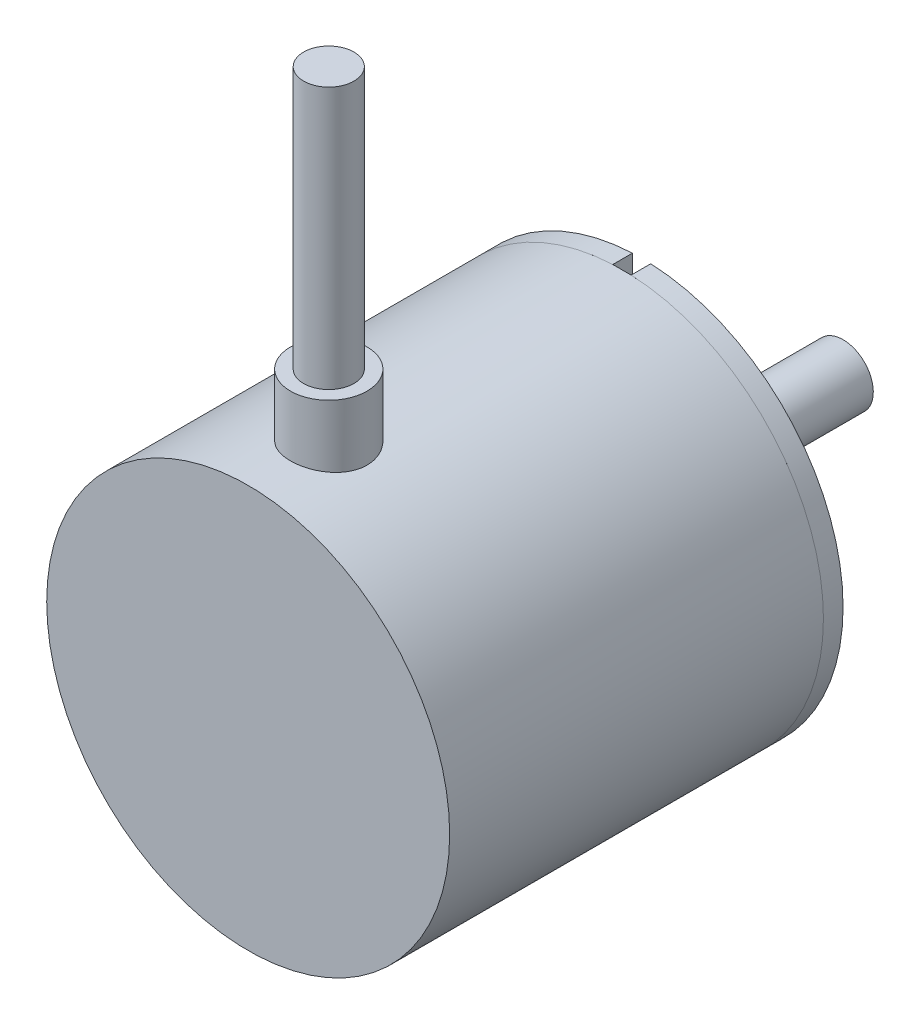
ISO-10303-21;
HEADER;
FILE_DESCRIPTION(('STEP AP214'),'2;1');
FILE_NAME('part.step','',(''),(''),'','','');
FILE_SCHEMA(('AUTOMOTIVE_DESIGN { 1 0 10303 214 1 1 1 1 }'));
ENDSEC;
DATA;
#1=APPLICATION_CONTEXT('core data for automotive mechanical design processes');
#2=APPLICATION_PROTOCOL_DEFINITION('international standard','automotive_design',2000,#1);
#3=PRODUCT_CONTEXT('',#1,'mechanical');
#4=PRODUCT('Part','Part','',(#3));
#5=PRODUCT_RELATED_PRODUCT_CATEGORY('part','',(#4));
#6=PRODUCT_DEFINITION_FORMATION('','',#4);
#7=PRODUCT_DEFINITION_CONTEXT('part definition',#1,'design');
#8=PRODUCT_DEFINITION('design','',#6,#7);
#9=PRODUCT_DEFINITION_SHAPE('','',#8);
#10=(LENGTH_UNIT() NAMED_UNIT(*) SI_UNIT(.MILLI.,.METRE.));
#11=(NAMED_UNIT(*) PLANE_ANGLE_UNIT() SI_UNIT($,.RADIAN.));
#12=(NAMED_UNIT(*) SI_UNIT($,.STERADIAN.) SOLID_ANGLE_UNIT());
#13=UNCERTAINTY_MEASURE_WITH_UNIT(LENGTH_MEASURE(1.E-05),#10,'distance_accuracy_value','');
#14=(GEOMETRIC_REPRESENTATION_CONTEXT(3) GLOBAL_UNCERTAINTY_ASSIGNED_CONTEXT((#13)) GLOBAL_UNIT_ASSIGNED_CONTEXT((#10,
#11,#12)) REPRESENTATION_CONTEXT('',''));
#15=CARTESIAN_POINT('',(0.,0.,0.));
#16=DIRECTION('',(0.,0.,1.));
#17=DIRECTION('',(1.,0.,0.));
#18=AXIS2_PLACEMENT_3D('',#15,#16,#17);
#19=CARTESIAN_POINT('',(0.,0.,0.));
#20=DIRECTION('',(0.,0.,1.));
#21=DIRECTION('',(1.,0.,0.));
#22=AXIS2_PLACEMENT_3D('',#19,#20,#21);
#23=PLANE('',#22);
#24=CARTESIAN_POINT('',(0.,0.,0.));
#25=DIRECTION('',(0.,0.,1.));
#26=DIRECTION('',(1.,0.,0.));
#27=AXIS2_PLACEMENT_3D('',#24,#25,#26);
#28=CIRCLE('',#27,10.);
#29=CARTESIAN_POINT('',(10.,0.,0.));
#30=VERTEX_POINT('',#29);
#31=EDGE_CURVE('E140',#30,#30,#28,.F.);
#32=ORIENTED_EDGE('',*,*,#31,.F.);
#33=EDGE_LOOP('',(#32));
#34=FACE_BOUND('',#33,.T.);
#35=CARTESIAN_POINT('',(0.,15.,0.));
#36=DIRECTION('',(0.,0.,-1.));
#37=DIRECTION('',(-1.,0.,0.));
#38=AXIS2_PLACEMENT_3D('',#35,#36,#37);
#39=CIRCLE('',#38,1.00000000000079);
#40=CARTESIAN_POINT('',(-1.00000000000079,15.,0.));
#41=VERTEX_POINT('',#40);
#42=EDGE_CURVE('E154',#41,#41,#39,.T.);
#43=ORIENTED_EDGE('',*,*,#42,.F.);
#44=EDGE_LOOP('',(#43));
#45=FACE_BOUND('',#44,.T.);
#46=CARTESIAN_POINT('',(-12.9903810567675,-7.49999999999947,0.));
#47=DIRECTION('',(0.,0.,-1.));
#48=DIRECTION('',(-1.,0.,0.));
#49=AXIS2_PLACEMENT_3D('',#46,#47,#48);
#50=CIRCLE('',#49,1.00000000000079);
#51=CARTESIAN_POINT('',(-13.9903810567683,-7.49999999999947,0.));
#52=VERTEX_POINT('',#51);
#53=EDGE_CURVE('E159',#52,#52,#50,.T.);
#54=ORIENTED_EDGE('',*,*,#53,.F.);
#55=EDGE_LOOP('',(#54));
#56=FACE_BOUND('',#55,.T.);
#57=CARTESIAN_POINT('',(12.9903810567657,-7.50000000000052,0.));
#58=DIRECTION('',(0.,0.,-1.));
#59=DIRECTION('',(-1.,0.,0.));
#60=AXIS2_PLACEMENT_3D('',#57,#58,#59);
#61=CIRCLE('',#60,1.00000000000079);
#62=CARTESIAN_POINT('',(11.9903810567649,-7.50000000000052,0.));
#63=VERTEX_POINT('',#62);
#64=EDGE_CURVE('E163',#63,#63,#61,.T.);
#65=ORIENTED_EDGE('',*,*,#64,.F.);
#66=EDGE_LOOP('',(#65));
#67=FACE_BOUND('',#66,.T.);
#68=DIRECTION('',(0.,-1.,0.));
#69=VECTOR('',#68,1.);
#70=CARTESIAN_POINT('',(-0.91,0.,0.));
#71=LINE('',#70,#69);
#72=CARTESIAN_POINT('',(-0.91,19.9792867740568,0.));
#73=VERTEX_POINT('',#72);
#74=CARTESIAN_POINT('',(-0.91,18.0794623505173,0.));
#75=VERTEX_POINT('',#74);
#76=EDGE_CURVE('E109',#73,#75,#71,.T.);
#77=ORIENTED_EDGE('',*,*,#76,.T.);
#78=DIRECTION('',(-1.,0.,0.));
#79=VECTOR('',#78,1.);
#80=CARTESIAN_POINT('',(0.,18.0794623505173,0.));
#81=LINE('',#80,#79);
#82=CARTESIAN_POINT('',(0.91,18.0794623505173,0.));
#83=VERTEX_POINT('',#82);
#84=EDGE_CURVE('E91',#83,#75,#81,.T.);
#85=ORIENTED_EDGE('',*,*,#84,.F.);
#86=DIRECTION('',(0.,-1.,0.));
#87=VECTOR('',#86,1.);
#88=CARTESIAN_POINT('',(0.91,0.,0.));
#89=LINE('',#88,#87);
#90=CARTESIAN_POINT('',(0.91,19.9792867740568,0.));
#91=VERTEX_POINT('',#90);
#92=EDGE_CURVE('E99',#91,#83,#89,.T.);
#93=ORIENTED_EDGE('',*,*,#92,.F.);
#94=CARTESIAN_POINT('',(0.,0.,0.));
#95=DIRECTION('',(0.,0.,1.));
#96=DIRECTION('',(1.,0.,0.));
#97=AXIS2_PLACEMENT_3D('',#94,#95,#96);
#98=CIRCLE('',#97,20.);
#99=EDGE_CURVE('E170',#73,#91,#98,.T.);
#100=ORIENTED_EDGE('',*,*,#99,.F.);
#101=EDGE_LOOP('',(#77,#85,#93,#100));
#102=FACE_BOUND('',#101,.T.);
#103=ADVANCED_FACE('F52',(#34,#45,#56,#67,#102),#23,.F.);
#104=CARTESIAN_POINT('',(0.,0.,1.95));
#105=DIRECTION('',(0.,0.,-1.));
#106=DIRECTION('',(-1.,0.,0.));
#107=AXIS2_PLACEMENT_3D('',#104,#105,#106);
#108=CYLINDRICAL_SURFACE('',#107,20.);
#109=DIRECTION('',(0.,0.,-1.));
#110=VECTOR('',#109,1.);
#111=CARTESIAN_POINT('',(-0.91,19.9792867740568,2.3));
#112=LINE('',#111,#110);
#113=CARTESIAN_POINT('',(-0.91,19.9792867740568,1.95));
#114=VERTEX_POINT('',#113);
#115=EDGE_CURVE('E121',#114,#73,#112,.T.);
#116=ORIENTED_EDGE('',*,*,#115,.T.);
#117=ORIENTED_EDGE('',*,*,#99,.T.);
#118=DIRECTION('',(0.,0.,-1.));
#119=VECTOR('',#118,1.);
#120=CARTESIAN_POINT('',(0.91,19.9792867740568,2.3));
#121=LINE('',#120,#119);
#122=CARTESIAN_POINT('',(0.91,19.9792867740568,1.95));
#123=VERTEX_POINT('',#122);
#124=EDGE_CURVE('E102',#123,#91,#121,.T.);
#125=ORIENTED_EDGE('',*,*,#124,.F.);
#126=CARTESIAN_POINT('',(0.,0.,1.95));
#127=DIRECTION('',(0.,0.,1.));
#128=DIRECTION('',(1.,0.,0.));
#129=AXIS2_PLACEMENT_3D('',#126,#127,#128);
#130=CIRCLE('',#129,20.);
#131=EDGE_CURVE('E141',#114,#123,#130,.T.);
#132=ORIENTED_EDGE('',*,*,#131,.F.);
#133=EDGE_LOOP('',(#116,#117,#125,#132));
#134=FACE_BOUND('',#133,.T.);
#135=ADVANCED_FACE('F192',(#134),#108,.T.);
#136=CARTESIAN_POINT('',(0.,0.,1.95));
#137=DIRECTION('',(0.,0.,1.));
#138=DIRECTION('',(1.,0.,0.));
#139=AXIS2_PLACEMENT_3D('',#136,#137,#138);
#140=PLANE('',#139);
#141=CARTESIAN_POINT('',(0.,15.,1.95));
#142=DIRECTION('',(0.,0.,1.));
#143=DIRECTION('',(1.,0.,0.));
#144=AXIS2_PLACEMENT_3D('',#141,#142,#143);
#145=CIRCLE('',#144,1.00000000000079);
#146=CARTESIAN_POINT('',(1.00000000000079,15.,1.95));
#147=VERTEX_POINT('',#146);
#148=EDGE_CURVE('E146',#147,#147,#145,.T.);
#149=ORIENTED_EDGE('',*,*,#148,.F.);
#150=EDGE_LOOP('',(#149));
#151=FACE_BOUND('',#150,.T.);
#152=CARTESIAN_POINT('',(-12.9903810567675,-7.49999999999947,1.95));
#153=DIRECTION('',(0.,0.,1.));
#154=DIRECTION('',(1.,0.,0.));
#155=AXIS2_PLACEMENT_3D('',#152,#153,#154);
#156=CIRCLE('',#155,1.00000000000079);
#157=CARTESIAN_POINT('',(-11.9903810567667,-7.49999999999947,1.95));
#158=VERTEX_POINT('',#157);
#159=EDGE_CURVE('E158',#158,#158,#156,.T.);
#160=ORIENTED_EDGE('',*,*,#159,.F.);
#161=EDGE_LOOP('',(#160));
#162=FACE_BOUND('',#161,.T.);
#163=CARTESIAN_POINT('',(12.9903810567657,-7.50000000000052,1.95));
#164=DIRECTION('',(0.,0.,1.));
#165=DIRECTION('',(1.,0.,0.));
#166=AXIS2_PLACEMENT_3D('',#163,#164,#165);
#167=CIRCLE('',#166,1.00000000000079);
#168=CARTESIAN_POINT('',(13.9903810567665,-7.50000000000052,1.95));
#169=VERTEX_POINT('',#168);
#170=EDGE_CURVE('E162',#169,#169,#167,.T.);
#171=ORIENTED_EDGE('',*,*,#170,.F.);
#172=EDGE_LOOP('',(#171));
#173=FACE_BOUND('',#172,.T.);
#174=DIRECTION('',(1.,0.,0.));
#175=VECTOR('',#174,1.);
#176=CARTESIAN_POINT('',(0.,18.0794623505173,1.95));
#177=LINE('',#176,#175);
#178=CARTESIAN_POINT('',(-0.91,18.0794623505173,1.95));
#179=VERTEX_POINT('',#178);
#180=CARTESIAN_POINT('',(0.91,18.0794623505173,1.95));
#181=VERTEX_POINT('',#180);
#182=EDGE_CURVE('E94',#179,#181,#177,.T.);
#183=ORIENTED_EDGE('',*,*,#182,.F.);
#184=DIRECTION('',(0.,1.,0.));
#185=VECTOR('',#184,1.);
#186=CARTESIAN_POINT('',(-0.91,0.,1.95));
#187=LINE('',#186,#185);
#188=EDGE_CURVE('E150',#179,#114,#187,.T.);
#189=ORIENTED_EDGE('',*,*,#188,.T.);
#190=ORIENTED_EDGE('',*,*,#131,.T.);
#191=DIRECTION('',(0.,1.,0.));
#192=VECTOR('',#191,1.);
#193=CARTESIAN_POINT('',(0.91,0.,1.95));
#194=LINE('',#193,#192);
#195=EDGE_CURVE('E111',#181,#123,#194,.T.);
#196=ORIENTED_EDGE('',*,*,#195,.F.);
#197=EDGE_LOOP('',(#183,#189,#190,#196));
#198=FACE_BOUND('',#197,.T.);
#199=ADVANCED_FACE('F133',(#151,#162,#173,#198),#140,.T.);
#200=CARTESIAN_POINT('',(0.,0.,-5.));
#201=DIRECTION('',(0.,0.,-1.));
#202=DIRECTION('',(-1.,0.,0.));
#203=AXIS2_PLACEMENT_3D('',#200,#201,#202);
#204=PLANE('',#203);
#205=CARTESIAN_POINT('',(0.,0.,-5.));
#206=DIRECTION('',(0.,0.,-1.));
#207=DIRECTION('',(-1.,0.,0.));
#208=AXIS2_PLACEMENT_3D('',#205,#206,#207);
#209=CIRCLE('',#208,7.5);
#210=CARTESIAN_POINT('',(-7.5,0.,-5.));
#211=VERTEX_POINT('',#210);
#212=EDGE_CURVE('E62',#211,#211,#209,.T.);
#213=ORIENTED_EDGE('',*,*,#212,.F.);
#214=EDGE_LOOP('',(#213));
#215=FACE_BOUND('',#214,.T.);
#216=CARTESIAN_POINT('',(0.,0.,-5.));
#217=DIRECTION('',(0.,0.,-1.));
#218=DIRECTION('',(-1.,0.,0.));
#219=AXIS2_PLACEMENT_3D('',#216,#217,#218);
#220=CIRCLE('',#219,10.);
#221=CARTESIAN_POINT('',(-10.,0.,-5.));
#222=VERTEX_POINT('',#221);
#223=EDGE_CURVE('E137',#222,#222,#220,.T.);
#224=ORIENTED_EDGE('',*,*,#223,.T.);
#225=EDGE_LOOP('',(#224));
#226=FACE_BOUND('',#225,.T.);
#227=ADVANCED_FACE('F129',(#215,#226),#204,.T.);
#228=CARTESIAN_POINT('',(0.,0.,-5.));
#229=DIRECTION('',(0.,0.,1.));
#230=DIRECTION('',(1.,0.,0.));
#231=AXIS2_PLACEMENT_3D('',#228,#229,#230);
#232=CYLINDRICAL_SURFACE('',#231,10.);
#233=ORIENTED_EDGE('',*,*,#223,.F.);
#234=EDGE_LOOP('',(#233));
#235=FACE_BOUND('',#234,.T.);
#236=ORIENTED_EDGE('',*,*,#31,.T.);
#237=EDGE_LOOP('',(#236));
#238=FACE_BOUND('',#237,.T.);
#239=ADVANCED_FACE('F132',(#235,#238),#232,.T.);
#240=CARTESIAN_POINT('',(0.,15.,10.));
#241=DIRECTION('',(0.,0.,-1.));
#242=DIRECTION('',(-1.,0.,0.));
#243=AXIS2_PLACEMENT_3D('',#240,#241,#242);
#244=CYLINDRICAL_SURFACE('',#243,1.00000000000079);
#245=ORIENTED_EDGE('',*,*,#148,.T.);
#246=EDGE_LOOP('',(#245));
#247=FACE_BOUND('',#246,.T.);
#248=ORIENTED_EDGE('',*,*,#42,.T.);
#249=EDGE_LOOP('',(#248));
#250=FACE_BOUND('',#249,.T.);
#251=ADVANCED_FACE('F205',(#247,#250),#244,.F.);
#252=CARTESIAN_POINT('',(-12.9903810567675,-7.49999999999947,10.));
#253=DIRECTION('',(0.,0.,-1.));
#254=DIRECTION('',(-1.,0.,0.));
#255=AXIS2_PLACEMENT_3D('',#252,#253,#254);
#256=CYLINDRICAL_SURFACE('',#255,1.00000000000079);
#257=ORIENTED_EDGE('',*,*,#159,.T.);
#258=EDGE_LOOP('',(#257));
#259=FACE_BOUND('',#258,.T.);
#260=ORIENTED_EDGE('',*,*,#53,.T.);
#261=EDGE_LOOP('',(#260));
#262=FACE_BOUND('',#261,.T.);
#263=ADVANCED_FACE('F209',(#259,#262),#256,.F.);
#264=CARTESIAN_POINT('',(12.9903810567657,-7.50000000000052,10.));
#265=DIRECTION('',(0.,0.,-1.));
#266=DIRECTION('',(-1.,0.,0.));
#267=AXIS2_PLACEMENT_3D('',#264,#265,#266);
#268=CYLINDRICAL_SURFACE('',#267,1.00000000000079);
#269=ORIENTED_EDGE('',*,*,#170,.T.);
#270=EDGE_LOOP('',(#269));
#271=FACE_BOUND('',#270,.T.);
#272=ORIENTED_EDGE('',*,*,#64,.T.);
#273=EDGE_LOOP('',(#272));
#274=FACE_BOUND('',#273,.T.);
#275=ADVANCED_FACE('F213',(#271,#274),#268,.F.);
#276=CARTESIAN_POINT('',(-0.91,0.,2.3));
#277=DIRECTION('',(1.,0.,0.));
#278=DIRECTION('',(0.,0.,-1.));
#279=AXIS2_PLACEMENT_3D('',#276,#277,#278);
#280=PLANE('',#279);
#281=DIRECTION('',(0.,0.,-1.));
#282=VECTOR('',#281,1.);
#283=CARTESIAN_POINT('',(-0.91,18.0794623505173,2.3));
#284=LINE('',#283,#282);
#285=EDGE_CURVE('E118',#179,#75,#284,.T.);
#286=ORIENTED_EDGE('',*,*,#285,.T.);
#287=ORIENTED_EDGE('',*,*,#76,.F.);
#288=ORIENTED_EDGE('',*,*,#115,.F.);
#289=ORIENTED_EDGE('',*,*,#188,.F.);
#290=EDGE_LOOP('',(#286,#287,#288,#289));
#291=FACE_BOUND('',#290,.T.);
#292=ADVANCED_FACE('F191',(#291),#280,.T.);
#293=CARTESIAN_POINT('',(0.,18.0794623505173,2.3));
#294=DIRECTION('',(0.,-1.,0.));
#295=DIRECTION('',(0.,0.,-1.));
#296=AXIS2_PLACEMENT_3D('',#293,#294,#295);
#297=PLANE('',#296);
#298=ORIENTED_EDGE('',*,*,#182,.T.);
#299=DIRECTION('',(0.,0.,-1.));
#300=VECTOR('',#299,1.);
#301=CARTESIAN_POINT('',(0.91,18.0794623505173,2.3));
#302=LINE('',#301,#300);
#303=EDGE_CURVE('E70',#181,#83,#302,.T.);
#304=ORIENTED_EDGE('',*,*,#303,.T.);
#305=ORIENTED_EDGE('',*,*,#84,.T.);
#306=ORIENTED_EDGE('',*,*,#285,.F.);
#307=EDGE_LOOP('',(#298,#304,#305,#306));
#308=FACE_BOUND('',#307,.T.);
#309=ADVANCED_FACE('F88',(#308),#297,.F.);
#310=CARTESIAN_POINT('',(0.91,0.,2.3));
#311=DIRECTION('',(1.,0.,0.));
#312=DIRECTION('',(0.,0.,-1.));
#313=AXIS2_PLACEMENT_3D('',#310,#311,#312);
#314=PLANE('',#313);
#315=ORIENTED_EDGE('',*,*,#195,.T.);
#316=ORIENTED_EDGE('',*,*,#124,.T.);
#317=ORIENTED_EDGE('',*,*,#92,.T.);
#318=ORIENTED_EDGE('',*,*,#303,.F.);
#319=EDGE_LOOP('',(#315,#316,#317,#318));
#320=FACE_BOUND('',#319,.T.);
#321=ADVANCED_FACE('F100',(#320),#314,.F.);
#322=CARTESIAN_POINT('',(0.,0.,-4.9));
#323=DIRECTION('',(0.,0.,-1.));
#324=DIRECTION('',(-1.,0.,0.));
#325=AXIS2_PLACEMENT_3D('',#322,#323,#324);
#326=CYLINDRICAL_SURFACE('',#325,7.5);
#327=CARTESIAN_POINT('',(0.,0.,-4.9));
#328=DIRECTION('',(0.,0.,-1.));
#329=DIRECTION('',(-1.,0.,0.));
#330=AXIS2_PLACEMENT_3D('',#327,#328,#329);
#331=CIRCLE('',#330,7.5);
#332=CARTESIAN_POINT('',(-7.5,0.,-4.9));
#333=VERTEX_POINT('',#332);
#334=EDGE_CURVE('E12',#333,#333,#331,.T.);
#335=ORIENTED_EDGE('',*,*,#334,.F.);
#336=EDGE_LOOP('',(#335));
#337=FACE_BOUND('',#336,.T.);
#338=ORIENTED_EDGE('',*,*,#212,.T.);
#339=EDGE_LOOP('',(#338));
#340=FACE_BOUND('',#339,.T.);
#341=ADVANCED_FACE('F127',(#337,#340),#326,.F.);
#342=CARTESIAN_POINT('',(0.,0.,-4.9));
#343=DIRECTION('',(0.,0.,-1.));
#344=DIRECTION('',(-1.,0.,0.));
#345=AXIS2_PLACEMENT_3D('',#342,#343,#344);
#346=PLANE('',#345);
#347=ORIENTED_EDGE('',*,*,#334,.T.);
#348=EDGE_LOOP('',(#347));
#349=FACE_BOUND('',#348,.T.);
#350=ADVANCED_FACE('F54',(#349),#346,.T.);
#351=CLOSED_SHELL('',(#103,#135,#199,#227,#239,#251,#263,#275,#292,#309,#321,#341,#350));
#352=MANIFOLD_SOLID_BREP('B2',#351);
#353=CARTESIAN_POINT('',(0.,26.,31.05));
#354=DIRECTION('',(0.,1.,0.));
#355=DIRECTION('',(0.,0.,1.));
#356=AXIS2_PLACEMENT_3D('',#353,#354,#355);
#357=PLANE('',#356);
#358=CARTESIAN_POINT('',(0.,26.,31.05));
#359=DIRECTION('',(0.,1.,0.));
#360=DIRECTION('',(0.,0.,1.));
#361=AXIS2_PLACEMENT_3D('',#358,#359,#360);
#362=CIRCLE('',#361,3.8);
#363=CARTESIAN_POINT('',(0.,26.,34.85));
#364=VERTEX_POINT('',#363);
#365=EDGE_CURVE('E388',#364,#364,#362,.T.);
#366=ORIENTED_EDGE('',*,*,#365,.T.);
#367=EDGE_LOOP('',(#366));
#368=FACE_BOUND('',#367,.T.);
#369=CARTESIAN_POINT('',(0.,26.,31.05));
#370=DIRECTION('',(0.,1.,0.));
#371=DIRECTION('',(0.,0.,1.));
#372=AXIS2_PLACEMENT_3D('',#369,#370,#371);
#373=CIRCLE('',#372,2.5);
#374=CARTESIAN_POINT('',(0.,26.,33.55));
#375=VERTEX_POINT('',#374);
#376=EDGE_CURVE('E394',#375,#375,#373,.T.);
#377=ORIENTED_EDGE('',*,*,#376,.F.);
#378=EDGE_LOOP('',(#377));
#379=FACE_BOUND('',#378,.T.);
#380=ADVANCED_FACE('F363',(#368,#379),#357,.T.);
#381=CARTESIAN_POINT('',(0.,0.,39.05));
#382=DIRECTION('',(0.,0.,-1.));
#383=DIRECTION('',(-1.,0.,0.));
#384=AXIS2_PLACEMENT_3D('',#381,#382,#383);
#385=CYLINDRICAL_SURFACE('',#384,20.);
#386=CARTESIAN_POINT('',(0.,0.,1.95));
#387=DIRECTION('',(0.,0.,1.));
#388=DIRECTION('',(1.,0.,0.));
#389=AXIS2_PLACEMENT_3D('',#386,#387,#388);
#390=CIRCLE('',#389,20.);
#391=CARTESIAN_POINT('',(20.,0.,1.95));
#392=VERTEX_POINT('',#391);
#393=EDGE_CURVE('E382',#392,#392,#390,.T.);
#394=ORIENTED_EDGE('',*,*,#393,.T.);
#395=EDGE_LOOP('',(#394));
#396=FACE_BOUND('',#395,.T.);
#397=CARTESIAN_POINT('',(0.,0.,39.05));
#398=DIRECTION('',(0.,0.,1.));
#399=DIRECTION('',(1.,0.,0.));
#400=AXIS2_PLACEMENT_3D('',#397,#398,#399);
#401=CIRCLE('',#400,20.);
#402=CARTESIAN_POINT('',(20.,0.,39.05));
#403=VERTEX_POINT('',#402);
#404=EDGE_CURVE('E376',#403,#403,#401,.T.);
#405=ORIENTED_EDGE('',*,*,#404,.F.);
#406=EDGE_LOOP('',(#405));
#407=FACE_BOUND('',#406,.T.);
#408=CARTESIAN_POINT('',(0.,20.,27.25));
#409=CARTESIAN_POINT('',(-0.211409170467327,19.9999961542323,27.2500080221101));
#410=CARTESIAN_POINT('',(-0.422922127898354,19.9966133928819,27.2677019195789));
#411=CARTESIAN_POINT('',(-0.839984159024682,19.9834449848688,27.3379623654532));
#412=CARTESIAN_POINT('',(-1.04552810753821,19.9736539963158,27.390558008419));
#413=CARTESIAN_POINT('',(-1.44456049920717,19.9487640007985,27.528950449601));
#414=CARTESIAN_POINT('',(-1.63805977200262,19.9336698456168,27.6147169075731));
#415=CARTESIAN_POINT('',(-2.00790510956374,19.8998203363427,27.8169294664745));
#416=CARTESIAN_POINT('',(-2.18425248934359,19.8810652632604,27.9333732128719));
#417=CARTESIAN_POINT('',(-2.51697105215255,19.8417053033425,28.195152721675));
#418=CARTESIAN_POINT('',(-2.67310113064527,19.8210823362121,28.3407922378417));
#419=CARTESIAN_POINT('',(-2.95886696734129,19.7804445961867,28.6561757865699));
#420=CARTESIAN_POINT('',(-3.08850079078569,19.7604298677961,28.8259215778409));
#421=CARTESIAN_POINT('',(-3.31860168020194,19.7230988451207,29.1864090605948));
#422=CARTESIAN_POINT('',(-3.41882262654874,19.705805853158,29.37731047713));
#423=CARTESIAN_POINT('',(-3.58567706988605,19.6761314285786,29.7736245855497));
#424=CARTESIAN_POINT('',(-3.6523135449711,19.6637495604899,29.9790359889224));
#425=CARTESIAN_POINT('',(-3.74933194374608,19.6454814650498,30.3959565887778));
#426=CARTESIAN_POINT('',(-3.78013484392349,19.6395198747464,30.607364455082));
#427=CARTESIAN_POINT('',(-3.80591857594181,19.634540186021,31.0324252533447));
#428=CARTESIAN_POINT('',(-3.80090270756635,19.6355214479927,31.2460779766861));
#429=CARTESIAN_POINT('',(-3.75553244831974,19.6442480072405,31.6665079036574));
#430=CARTESIAN_POINT('',(-3.71565751410713,19.6519015293418,31.8733390341715));
#431=CARTESIAN_POINT('',(-3.60245643623646,19.6729660265244,32.277321398546));
#432=CARTESIAN_POINT('',(-3.52912883658626,19.6863772522022,32.4744722106669));
#433=CARTESIAN_POINT('',(-3.35063720584687,19.7175415756265,32.8548962890743));
#434=CARTESIAN_POINT('',(-3.24528027247544,19.7353208526614,33.038076814078));
#435=CARTESIAN_POINT('',(-3.00585703473046,19.7732007899193,33.3843394509841));
#436=CARTESIAN_POINT('',(-2.87178774114429,19.7933016917437,33.5474194674571));
#437=CARTESIAN_POINT('',(-2.57616400040746,19.8339594539179,33.8516213185564));
#438=CARTESIAN_POINT('',(-2.41419962980204,19.8545184267878,33.9923448095286));
#439=CARTESIAN_POINT('',(-2.06875314340881,19.8934769245016,34.244684963348));
#440=CARTESIAN_POINT('',(-1.88527080077558,19.9118764265761,34.3563013193038));
#441=CARTESIAN_POINT('',(-1.50157598041669,19.9444815207307,34.5473204324655));
#442=CARTESIAN_POINT('',(-1.30134198123535,19.9586816081353,34.6266809586306));
#443=CARTESIAN_POINT('',(-0.890054959011917,19.9812455258448,34.7505286338464));
#444=CARTESIAN_POINT('',(-0.679003119317512,19.9896099930434,34.7950195885914));
#445=CARTESIAN_POINT('',(-0.255497719579876,19.9994725007416,34.8473088773612));
#446=CARTESIAN_POINT('',(-0.0431138328322673,20.0010726444528,34.855652875173));
#447=CARTESIAN_POINT('',(0.380014191672976,19.9975085572427,34.836876225767));
#448=CARTESIAN_POINT('',(0.590758411707601,19.9923446679653,34.8097573697398));
#449=CARTESIAN_POINT('',(1.00288830549625,19.975896378801,34.7212784196605));
#450=CARTESIAN_POINT('',(1.20433556626006,19.9646614874827,34.6601951873359));
#451=CARTESIAN_POINT('',(1.59412952640163,19.9373258457065,34.5058215920311));
#452=CARTESIAN_POINT('',(1.78247531674335,19.9212247580245,34.4125289969003));
#453=CARTESIAN_POINT('',(2.14304328890291,19.8856880666302,34.195182519842));
#454=CARTESIAN_POINT('',(2.31506151518706,19.8662171733405,34.0707961735566));
#455=CARTESIAN_POINT('',(2.63597913374777,19.8261901171718,33.7952420238678));
#456=CARTESIAN_POINT('',(2.78487630264077,19.8056338501746,33.6440716478284));
#457=CARTESIAN_POINT('',(3.05740496097472,19.765413070904,33.3167675589537));
#458=CARTESIAN_POINT('',(3.18066362671236,19.7457645712979,33.1403211179015));
#459=CARTESIAN_POINT('',(3.39579291791139,19.7099095371909,32.7689070607635));
#460=CARTESIAN_POINT('',(3.48766472876849,19.6937028727101,32.5739401445009));
#461=CARTESIAN_POINT('',(3.63688763834375,19.6666928737216,32.1719537976212));
#462=CARTESIAN_POINT('',(3.69440774330493,19.65586313059,31.9649989621616));
#463=CARTESIAN_POINT('',(3.77381405210164,19.6407736637121,31.5441366655658));
#464=CARTESIAN_POINT('',(3.79570439701343,19.6365131764557,31.3302300153537));
#465=CARTESIAN_POINT('',(3.80308834618145,19.6350840546938,30.9052722601002));
#466=CARTESIAN_POINT('',(3.78917023724654,19.6378007920638,30.694231539121));
#467=CARTESIAN_POINT('',(3.72662235451709,19.6497654576093,30.2775567264854));
#468=CARTESIAN_POINT('',(3.67799280145929,19.6590133442521,30.071922600456));
#469=CARTESIAN_POINT('',(3.5476534675359,19.682949445638,29.6722259316191));
#470=CARTESIAN_POINT('',(3.46600904087706,19.6976269074675,29.4781413916689));
#471=CARTESIAN_POINT('',(3.27202248901276,19.7307756869829,29.1063314638588));
#472=CARTESIAN_POINT('',(3.159678114922,19.7492472825785,28.9286072757309));
#473=CARTESIAN_POINT('',(2.90544249950504,19.7882578785796,28.5916195556383));
#474=CARTESIAN_POINT('',(2.76312375644477,19.8088242859378,28.4326816630379));
#475=CARTESIAN_POINT('',(2.45386904920005,19.849503793334,28.1407474229982));
#476=CARTESIAN_POINT('',(2.28692743807455,19.8696167881647,28.0077570425845));
#477=CARTESIAN_POINT('',(1.93130804184856,19.907342517305,27.7703371149878));
#478=CARTESIAN_POINT('',(1.74244286895555,19.9249303089506,27.6661841532342));
#479=CARTESIAN_POINT('',(1.34961886753758,19.955380052388,27.4912547671515));
#480=CARTESIAN_POINT('',(1.1456743110793,19.9682464057595,27.4204472388684));
#481=CARTESIAN_POINT('',(0.784297688068416,19.9852044773219,27.328466621649));
#482=CARTESIAN_POINT('',(0.628967830047845,19.9907212439867,27.2990923477028));
#483=CARTESIAN_POINT('',(0.315777906585669,19.9981203933227,27.2598563003173));
#484=CARTESIAN_POINT('',(0.157917908583858,20.0000028727022,27.2499940076637));
#485=CARTESIAN_POINT('',(0.,20.,27.25));
#486=B_SPLINE_CURVE_WITH_KNOTS('',3,(#408,#409,#410,#411,#412,#413,#414,#415,#416,#417,#418,
#419,#420,#421,#422,#423,#424,#425,#426,#427,#428,#429,#430,#431,#432,#433,#434,#435,#436,#437,
#438,#439,#440,#441,#442,#443,#444,#445,#446,#447,#448,#449,#450,#451,#452,#453,#454,#455,#456,
#457,#458,#459,#460,#461,#462,#463,#464,#465,#466,#467,#468,#469,#470,#471,#472,#473,#474,#475,
#476,#477,#478,#479,#480,#481,#482,#483,#484,#485),.UNSPECIFIED.,.T.,.F.,(4,2,2,2,2,2,2,2,2,2,2,
2,2,2,2,2,2,2,2,2,2,2,2,2,2,2,2,2,2,2,2,2,2,2,2,2,2,2,4),(0.,0.633649957641686,1.26782879901445,
1.901428944657,2.53498047461306,3.17550182400964,3.81606992763611,4.4618545644225,
5.10758192633874,5.74564406057233,6.38364741445397,7.01301124078936,7.64240246213848,
8.27566203182482,8.90898756155413,9.55256883556786,10.1961568949143,10.8405848804157,
11.4849425227049,12.1195384701565,12.7541023660826,13.3835678603608,14.0130769861719,
14.6496287228807,15.2862416342732,15.931548745728,16.5768314830023,17.2189127787949,
17.8609194432256,18.4924463579162,19.1239692566416,19.7542481040081,20.3845731340266,
21.0245839956356,21.6647418644649,22.3108422133651,22.9563386931751,23.4296735948471,
23.9029959008938),.UNSPECIFIED.);
#487=CARTESIAN_POINT('',(0.,20.,27.25));
#488=VERTEX_POINT('',#487);
#489=EDGE_CURVE('E51',#488,#488,#486,.T.);
#490=ORIENTED_EDGE('',*,*,#489,.F.);
#491=EDGE_LOOP('',(#490));
#492=FACE_BOUND('',#491,.T.);
#493=ADVANCED_FACE('F365',(#396,#407,#492),#385,.T.);
#494=CARTESIAN_POINT('',(0.,0.,39.05));
#495=DIRECTION('',(0.,0.,1.));
#496=DIRECTION('',(1.,0.,0.));
#497=AXIS2_PLACEMENT_3D('',#494,#495,#496);
#498=PLANE('',#497);
#499=ORIENTED_EDGE('',*,*,#404,.T.);
#500=EDGE_LOOP('',(#499));
#501=FACE_BOUND('',#500,.T.);
#502=ADVANCED_FACE('F416',(#501),#498,.T.);
#503=CARTESIAN_POINT('',(0.,0.,1.95));
#504=DIRECTION('',(0.,0.,1.));
#505=DIRECTION('',(1.,0.,0.));
#506=AXIS2_PLACEMENT_3D('',#503,#504,#505);
#507=PLANE('',#506);
#508=ORIENTED_EDGE('',*,*,#393,.F.);
#509=EDGE_LOOP('',(#508));
#510=FACE_BOUND('',#509,.T.);
#511=ADVANCED_FACE('F422',(#510),#507,.F.);
#512=CARTESIAN_POINT('',(0.,26.,31.05));
#513=DIRECTION('',(0.,-1.,0.));
#514=DIRECTION('',(0.,0.,-1.));
#515=AXIS2_PLACEMENT_3D('',#512,#513,#514);
#516=CYLINDRICAL_SURFACE('',#515,3.8);
#517=ORIENTED_EDGE('',*,*,#365,.F.);
#518=EDGE_LOOP('',(#517));
#519=FACE_BOUND('',#518,.T.);
#520=ORIENTED_EDGE('',*,*,#489,.T.);
#521=EDGE_LOOP('',(#520));
#522=FACE_BOUND('',#521,.T.);
#523=ADVANCED_FACE('F406',(#519,#522),#516,.T.);
#524=CARTESIAN_POINT('',(0.,52.,31.05));
#525=DIRECTION('',(0.,-1.,0.));
#526=DIRECTION('',(0.,0.,-1.));
#527=AXIS2_PLACEMENT_3D('',#524,#525,#526);
#528=CYLINDRICAL_SURFACE('',#527,2.5);
#529=CARTESIAN_POINT('',(0.,52.,31.05));
#530=DIRECTION('',(0.,1.,0.));
#531=DIRECTION('',(0.,0.,1.));
#532=AXIS2_PLACEMENT_3D('',#529,#530,#531);
#533=CIRCLE('',#532,2.5);
#534=CARTESIAN_POINT('',(0.,52.,33.55));
#535=VERTEX_POINT('',#534);
#536=EDGE_CURVE('E393',#535,#535,#533,.T.);
#537=ORIENTED_EDGE('',*,*,#536,.F.);
#538=EDGE_LOOP('',(#537));
#539=FACE_BOUND('',#538,.T.);
#540=ORIENTED_EDGE('',*,*,#376,.T.);
#541=EDGE_LOOP('',(#540));
#542=FACE_BOUND('',#541,.T.);
#543=ADVANCED_FACE('F403',(#539,#542),#528,.T.);
#544=CARTESIAN_POINT('',(0.,52.,31.05));
#545=DIRECTION('',(0.,1.,0.));
#546=DIRECTION('',(0.,0.,1.));
#547=AXIS2_PLACEMENT_3D('',#544,#545,#546);
#548=PLANE('',#547);
#549=ORIENTED_EDGE('',*,*,#536,.T.);
#550=EDGE_LOOP('',(#549));
#551=FACE_BOUND('',#550,.T.);
#552=ADVANCED_FACE('F401',(#551),#548,.T.);
#553=CLOSED_SHELL('',(#380,#493,#502,#511,#523,#543,#552));
#554=MANIFOLD_SOLID_BREP('B6',#553);
#555=CARTESIAN_POINT('',(0.,0.,-20.));
#556=DIRECTION('',(0.,0.,-1.));
#557=DIRECTION('',(-1.,0.,0.));
#558=AXIS2_PLACEMENT_3D('',#555,#556,#557);
#559=PLANE('',#558);
#560=DIRECTION('',(1.,0.,0.));
#561=VECTOR('',#560,1.);
#562=CARTESIAN_POINT('',(2.92743788288171,-2.,-20.));
#563=LINE('',#562,#561);
#564=CARTESIAN_POINT('',(-2.23606797749979,-2.,-20.));
#565=VERTEX_POINT('',#564);
#566=CARTESIAN_POINT('',(2.23606797749979,-2.,-20.));
#567=VERTEX_POINT('',#566);
#568=EDGE_CURVE('E511',#565,#567,#563,.T.);
#569=ORIENTED_EDGE('',*,*,#568,.F.);
#570=CARTESIAN_POINT('',(0.,0.,-20.));
#571=DIRECTION('',(0.,0.,-1.));
#572=DIRECTION('',(-1.,0.,0.));
#573=AXIS2_PLACEMENT_3D('',#570,#571,#572);
#574=CIRCLE('',#573,3.);
#575=EDGE_CURVE('E517',#565,#567,#574,.T.);
#576=ORIENTED_EDGE('',*,*,#575,.T.);
#577=EDGE_LOOP('',(#569,#576));
#578=FACE_BOUND('',#577,.T.);
#579=ADVANCED_FACE('F484',(#578),#559,.T.);
#580=CARTESIAN_POINT('',(0.,0.,-20.));
#581=DIRECTION('',(0.,0.,1.));
#582=DIRECTION('',(1.,0.,0.));
#583=AXIS2_PLACEMENT_3D('',#580,#581,#582);
#584=CYLINDRICAL_SURFACE('',#583,3.);
#585=ORIENTED_EDGE('',*,*,#575,.F.);
#586=DIRECTION('',(0.,0.,1.));
#587=VECTOR('',#586,1.);
#588=CARTESIAN_POINT('',(-2.23606797749979,-2.,-20.));
#589=LINE('',#588,#587);
#590=CARTESIAN_POINT('',(-2.23606797749979,-2.,-11.));
#591=VERTEX_POINT('',#590);
#592=EDGE_CURVE('E361',#565,#591,#589,.T.);
#593=ORIENTED_EDGE('',*,*,#592,.T.);
#594=CARTESIAN_POINT('',(0.,0.,-11.));
#595=DIRECTION('',(0.,0.,1.));
#596=DIRECTION('',(1.,0.,0.));
#597=AXIS2_PLACEMENT_3D('',#594,#595,#596);
#598=CIRCLE('',#597,3.);
#599=CARTESIAN_POINT('',(2.23606797749979,-2.,-11.));
#600=VERTEX_POINT('',#599);
#601=EDGE_CURVE('E502',#591,#600,#598,.T.);
#602=ORIENTED_EDGE('',*,*,#601,.T.);
#603=DIRECTION('',(0.,0.,1.));
#604=VECTOR('',#603,1.);
#605=CARTESIAN_POINT('',(2.23606797749979,-2.,-20.));
#606=LINE('',#605,#604);
#607=EDGE_CURVE('E492',#600,#567,#606,.F.);
#608=ORIENTED_EDGE('',*,*,#607,.T.);
#609=EDGE_LOOP('',(#585,#593,#602,#608));
#610=FACE_BOUND('',#609,.T.);
#611=CARTESIAN_POINT('',(0.,0.,-5.));
#612=DIRECTION('',(0.,0.,-1.));
#613=DIRECTION('',(-1.,0.,0.));
#614=AXIS2_PLACEMENT_3D('',#611,#612,#613);
#615=CIRCLE('',#614,3.);
#616=CARTESIAN_POINT('',(-3.,0.,-5.));
#617=VERTEX_POINT('',#616);
#618=EDGE_CURVE('E521',#617,#617,#615,.T.);
#619=ORIENTED_EDGE('',*,*,#618,.T.);
#620=EDGE_LOOP('',(#619));
#621=FACE_BOUND('',#620,.T.);
#622=ADVANCED_FACE('F486',(#610,#621),#584,.T.);
#623=CARTESIAN_POINT('',(0.,0.,-5.));
#624=DIRECTION('',(0.,0.,-1.));
#625=DIRECTION('',(-1.,0.,0.));
#626=AXIS2_PLACEMENT_3D('',#623,#624,#625);
#627=PLANE('',#626);
#628=ORIENTED_EDGE('',*,*,#618,.F.);
#629=EDGE_LOOP('',(#628));
#630=FACE_BOUND('',#629,.T.);
#631=ADVANCED_FACE('F530',(#630),#627,.F.);
#632=CARTESIAN_POINT('',(2.92743788288171,-2.,-11.));
#633=DIRECTION('',(0.,1.,0.));
#634=DIRECTION('',(0.,0.,1.));
#635=AXIS2_PLACEMENT_3D('',#632,#633,#634);
#636=PLANE('',#635);
#637=ORIENTED_EDGE('',*,*,#568,.T.);
#638=ORIENTED_EDGE('',*,*,#607,.F.);
#639=DIRECTION('',(1.,0.,0.));
#640=VECTOR('',#639,1.);
#641=CARTESIAN_POINT('',(2.92743788288171,-2.,-11.));
#642=LINE('',#641,#640);
#643=EDGE_CURVE('E498',#591,#600,#642,.T.);
#644=ORIENTED_EDGE('',*,*,#643,.F.);
#645=ORIENTED_EDGE('',*,*,#592,.F.);
#646=EDGE_LOOP('',(#637,#638,#644,#645));
#647=FACE_BOUND('',#646,.T.);
#648=ADVANCED_FACE('F510',(#647),#636,.F.);
#649=CARTESIAN_POINT('',(0.,0.,-11.));
#650=DIRECTION('',(0.,0.,1.));
#651=DIRECTION('',(1.,0.,0.));
#652=AXIS2_PLACEMENT_3D('',#649,#650,#651);
#653=PLANE('',#652);
#654=ORIENTED_EDGE('',*,*,#643,.T.);
#655=ORIENTED_EDGE('',*,*,#601,.F.);
#656=EDGE_LOOP('',(#654,#655));
#657=FACE_BOUND('',#656,.T.);
#658=ADVANCED_FACE('F537',(#657),#653,.F.);
#659=CLOSED_SHELL('',(#579,#622,#631,#648,#658));
#660=MANIFOLD_SOLID_BREP('B46',#659);
#661=ADVANCED_BREP_SHAPE_REPRESENTATION('',(#18,#352,#554,#660),#14);
#662=SHAPE_DEFINITION_REPRESENTATION(#9,#661);
ENDSEC;
END-ISO-10303-21;
